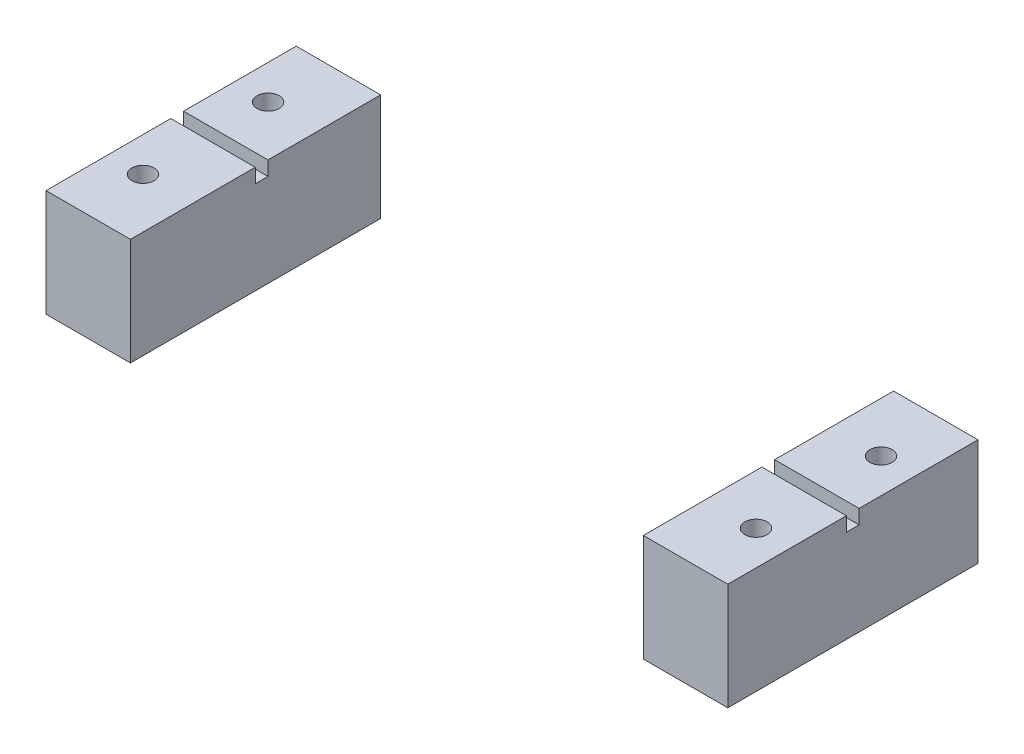
ISO-10303-21;
HEADER;
FILE_DESCRIPTION(('STEP AP214'),'2;1');
FILE_NAME('part.step','',(''),(''),'','','');
FILE_SCHEMA(('AUTOMOTIVE_DESIGN { 1 0 10303 214 1 1 1 1 }'));
ENDSEC;
DATA;
#1=APPLICATION_CONTEXT('core data for automotive mechanical design processes');
#2=APPLICATION_PROTOCOL_DEFINITION('international standard','automotive_design',2000,#1);
#3=PRODUCT_CONTEXT('',#1,'mechanical');
#4=PRODUCT('Part','Part','',(#3));
#5=PRODUCT_RELATED_PRODUCT_CATEGORY('part','',(#4));
#6=PRODUCT_DEFINITION_FORMATION('','',#4);
#7=PRODUCT_DEFINITION_CONTEXT('part definition',#1,'design');
#8=PRODUCT_DEFINITION('design','',#6,#7);
#9=PRODUCT_DEFINITION_SHAPE('','',#8);
#10=(LENGTH_UNIT() NAMED_UNIT(*) SI_UNIT(.MILLI.,.METRE.));
#11=(NAMED_UNIT(*) PLANE_ANGLE_UNIT() SI_UNIT($,.RADIAN.));
#12=(NAMED_UNIT(*) SI_UNIT($,.STERADIAN.) SOLID_ANGLE_UNIT());
#13=UNCERTAINTY_MEASURE_WITH_UNIT(LENGTH_MEASURE(1.E-05),#10,'distance_accuracy_value','');
#14=(GEOMETRIC_REPRESENTATION_CONTEXT(3) GLOBAL_UNCERTAINTY_ASSIGNED_CONTEXT((#13)) GLOBAL_UNIT_ASSIGNED_CONTEXT((#10,
#11,#12)) REPRESENTATION_CONTEXT('',''));
#15=CARTESIAN_POINT('',(0.,0.,0.));
#16=DIRECTION('',(0.,0.,1.));
#17=DIRECTION('',(1.,0.,0.));
#18=AXIS2_PLACEMENT_3D('',#15,#16,#17);
#19=CARTESIAN_POINT('',(0.,8.5598,0.));
#20=DIRECTION('',(0.,1.,0.));
#21=DIRECTION('',(0.,0.,-1.));
#22=AXIS2_PLACEMENT_3D('',#19,#20,#21);
#23=PLANE('',#22);
#24=DIRECTION('',(-1.,0.,0.));
#25=VECTOR('',#24,1.);
#26=CARTESIAN_POINT('',(54.5,8.5598,10.5214854290003));
#27=LINE('',#26,#25);
#28=CARTESIAN_POINT('',(54.5,8.5598,10.5214854290003));
#29=VERTEX_POINT('',#28);
#30=CARTESIAN_POINT('',(47.75,8.5598,10.5214854290003));
#31=VERTEX_POINT('',#30);
#32=EDGE_CURVE('E141',#29,#31,#27,.T.);
#33=ORIENTED_EDGE('',*,*,#32,.T.);
#34=DIRECTION('',(0.,0.,1.));
#35=VECTOR('',#34,1.);
#36=CARTESIAN_POINT('',(47.75,8.5598,0.));
#37=LINE('',#36,#35);
#38=CARTESIAN_POINT('',(47.75,8.5598,20.));
#39=VERTEX_POINT('',#38);
#40=EDGE_CURVE('E161',#31,#39,#37,.T.);
#41=ORIENTED_EDGE('',*,*,#40,.T.);
#42=DIRECTION('',(1.,0.,0.));
#43=VECTOR('',#42,1.);
#44=CARTESIAN_POINT('',(0.,8.5598,20.));
#45=LINE('',#44,#43);
#46=CARTESIAN_POINT('',(54.5,8.5598,20.));
#47=VERTEX_POINT('',#46);
#48=EDGE_CURVE('E157',#39,#47,#45,.T.);
#49=ORIENTED_EDGE('',*,*,#48,.T.);
#50=DIRECTION('',(0.,0.,1.));
#51=VECTOR('',#50,1.);
#52=CARTESIAN_POINT('',(54.5,8.5598,0.));
#53=LINE('',#52,#51);
#54=EDGE_CURVE('E167',#29,#47,#53,.T.);
#55=ORIENTED_EDGE('',*,*,#54,.F.);
#56=EDGE_LOOP('',(#33,#41,#49,#55));
#57=FACE_BOUND('',#56,.T.);
#58=CARTESIAN_POINT('',(51.75,8.5598,15.));
#59=DIRECTION('',(0.,-1.,0.));
#60=DIRECTION('',(0.,0.,-1.));
#61=AXIS2_PLACEMENT_3D('',#58,#59,#60);
#62=CIRCLE('',#61,0.889000000000003);
#63=CARTESIAN_POINT('',(51.75,8.5598,14.111));
#64=VERTEX_POINT('',#63);
#65=EDGE_CURVE('E154',#64,#64,#62,.T.);
#66=ORIENTED_EDGE('',*,*,#65,.T.);
#67=EDGE_LOOP('',(#66));
#68=FACE_BOUND('',#67,.T.);
#69=ADVANCED_FACE('F49',(#57,#68),#23,.T.);
#70=CARTESIAN_POINT('',(0.,8.5598,20.));
#71=DIRECTION('',(0.,0.,1.));
#72=DIRECTION('',(-1.,0.,0.));
#73=AXIS2_PLACEMENT_3D('',#70,#71,#72);
#74=PLANE('',#73);
#75=DIRECTION('',(1.,0.,0.));
#76=VECTOR('',#75,1.);
#77=CARTESIAN_POINT('',(0.,0.,20.));
#78=LINE('',#77,#76);
#79=CARTESIAN_POINT('',(47.75,0.,20.));
#80=VERTEX_POINT('',#79);
#81=CARTESIAN_POINT('',(54.5,0.,20.));
#82=VERTEX_POINT('',#81);
#83=EDGE_CURVE('E176',#80,#82,#78,.T.);
#84=ORIENTED_EDGE('',*,*,#83,.T.);
#85=DIRECTION('',(0.,-1.,0.));
#86=VECTOR('',#85,1.);
#87=CARTESIAN_POINT('',(54.5,8.5598,20.));
#88=LINE('',#87,#86);
#89=EDGE_CURVE('E73',#47,#82,#88,.T.);
#90=ORIENTED_EDGE('',*,*,#89,.F.);
#91=ORIENTED_EDGE('',*,*,#48,.F.);
#92=DIRECTION('',(0.,-1.,0.));
#93=VECTOR('',#92,1.);
#94=CARTESIAN_POINT('',(47.75,8.5598,20.));
#95=LINE('',#94,#93);
#96=EDGE_CURVE('E12',#39,#80,#95,.T.);
#97=ORIENTED_EDGE('',*,*,#96,.T.);
#98=EDGE_LOOP('',(#84,#90,#91,#97));
#99=FACE_BOUND('',#98,.T.);
#100=ADVANCED_FACE('F196',(#99),#74,.T.);
#101=CARTESIAN_POINT('',(47.75,8.5598,0.));
#102=DIRECTION('',(-1.,0.,0.));
#103=DIRECTION('',(0.,0.,-1.));
#104=AXIS2_PLACEMENT_3D('',#101,#102,#103);
#105=PLANE('',#104);
#106=DIRECTION('',(0.,1.,0.));
#107=VECTOR('',#106,1.);
#108=CARTESIAN_POINT('',(47.75,7.4168,10.5214854290003));
#109=LINE('',#108,#107);
#110=CARTESIAN_POINT('',(47.75,7.4168,10.5214854290003));
#111=VERTEX_POINT('',#110);
#112=EDGE_CURVE('E140',#111,#31,#109,.T.);
#113=ORIENTED_EDGE('',*,*,#112,.F.);
#114=DIRECTION('',(0.,0.,-1.));
#115=VECTOR('',#114,1.);
#116=CARTESIAN_POINT('',(47.75,7.4168,10.5214854290003));
#117=LINE('',#116,#115);
#118=CARTESIAN_POINT('',(47.75,7.4168,9.50548542900026));
#119=VERTEX_POINT('',#118);
#120=EDGE_CURVE('E126',#111,#119,#117,.T.);
#121=ORIENTED_EDGE('',*,*,#120,.T.);
#122=DIRECTION('',(0.,1.,0.));
#123=VECTOR('',#122,1.);
#124=CARTESIAN_POINT('',(47.75,7.4168,9.50548542900026));
#125=LINE('',#124,#123);
#126=CARTESIAN_POINT('',(47.75,8.5598,9.50548542900026));
#127=VERTEX_POINT('',#126);
#128=EDGE_CURVE('E133',#119,#127,#125,.T.);
#129=ORIENTED_EDGE('',*,*,#128,.T.);
#130=CARTESIAN_POINT('',(47.75,8.5598,0.));
#131=VERTEX_POINT('',#130);
#132=EDGE_CURVE('E162',#131,#127,#37,.T.);
#133=ORIENTED_EDGE('',*,*,#132,.F.);
#134=DIRECTION('',(0.,-1.,0.));
#135=VECTOR('',#134,1.);
#136=CARTESIAN_POINT('',(47.75,8.5598,0.));
#137=LINE('',#136,#135);
#138=CARTESIAN_POINT('',(47.75,0.,0.));
#139=VERTEX_POINT('',#138);
#140=EDGE_CURVE('E57',#131,#139,#137,.T.);
#141=ORIENTED_EDGE('',*,*,#140,.T.);
#142=DIRECTION('',(0.,0.,1.));
#143=VECTOR('',#142,1.);
#144=CARTESIAN_POINT('',(47.75,0.,0.));
#145=LINE('',#144,#143);
#146=EDGE_CURVE('E178',#139,#80,#145,.T.);
#147=ORIENTED_EDGE('',*,*,#146,.T.);
#148=ORIENTED_EDGE('',*,*,#96,.F.);
#149=ORIENTED_EDGE('',*,*,#40,.F.);
#150=EDGE_LOOP('',(#113,#121,#129,#133,#141,#147,#148,#149));
#151=FACE_BOUND('',#150,.T.);
#152=ADVANCED_FACE('F139',(#151),#105,.T.);
#153=CARTESIAN_POINT('',(0.,8.5598,0.));
#154=DIRECTION('',(0.,0.,1.));
#155=DIRECTION('',(-1.,0.,0.));
#156=AXIS2_PLACEMENT_3D('',#153,#154,#155);
#157=PLANE('',#156);
#158=DIRECTION('',(1.,0.,0.));
#159=VECTOR('',#158,1.);
#160=CARTESIAN_POINT('',(0.,0.,0.));
#161=LINE('',#160,#159);
#162=CARTESIAN_POINT('',(54.5,0.,0.));
#163=VERTEX_POINT('',#162);
#164=EDGE_CURVE('E180',#139,#163,#161,.T.);
#165=ORIENTED_EDGE('',*,*,#164,.F.);
#166=ORIENTED_EDGE('',*,*,#140,.F.);
#167=DIRECTION('',(1.,0.,0.));
#168=VECTOR('',#167,1.);
#169=CARTESIAN_POINT('',(0.,8.5598,0.));
#170=LINE('',#169,#168);
#171=CARTESIAN_POINT('',(54.5,8.5598,0.));
#172=VERTEX_POINT('',#171);
#173=EDGE_CURVE('E164',#131,#172,#170,.T.);
#174=ORIENTED_EDGE('',*,*,#173,.T.);
#175=DIRECTION('',(0.,-1.,0.));
#176=VECTOR('',#175,1.);
#177=CARTESIAN_POINT('',(54.5,8.5598,0.));
#178=LINE('',#177,#176);
#179=EDGE_CURVE('E186',#172,#163,#178,.T.);
#180=ORIENTED_EDGE('',*,*,#179,.T.);
#181=EDGE_LOOP('',(#165,#166,#174,#180));
#182=FACE_BOUND('',#181,.T.);
#183=ADVANCED_FACE('F192',(#182),#157,.F.);
#184=CARTESIAN_POINT('',(54.5,8.5598,0.));
#185=DIRECTION('',(-1.,0.,0.));
#186=DIRECTION('',(0.,0.,-1.));
#187=AXIS2_PLACEMENT_3D('',#184,#185,#186);
#188=PLANE('',#187);
#189=ORIENTED_EDGE('',*,*,#54,.T.);
#190=ORIENTED_EDGE('',*,*,#89,.T.);
#191=DIRECTION('',(0.,0.,1.));
#192=VECTOR('',#191,1.);
#193=CARTESIAN_POINT('',(54.5,0.,0.));
#194=LINE('',#193,#192);
#195=EDGE_CURVE('E95',#163,#82,#194,.T.);
#196=ORIENTED_EDGE('',*,*,#195,.F.);
#197=ORIENTED_EDGE('',*,*,#179,.F.);
#198=CARTESIAN_POINT('',(54.5,8.5598,9.50548542900026));
#199=VERTEX_POINT('',#198);
#200=EDGE_CURVE('E168',#172,#199,#53,.T.);
#201=ORIENTED_EDGE('',*,*,#200,.T.);
#202=DIRECTION('',(0.,1.,0.));
#203=VECTOR('',#202,1.);
#204=CARTESIAN_POINT('',(54.5,7.4168,9.50548542900026));
#205=LINE('',#204,#203);
#206=CARTESIAN_POINT('',(54.5,7.4168,9.50548542900026));
#207=VERTEX_POINT('',#206);
#208=EDGE_CURVE('E136',#207,#199,#205,.T.);
#209=ORIENTED_EDGE('',*,*,#208,.F.);
#210=DIRECTION('',(0.,0.,1.));
#211=VECTOR('',#210,1.);
#212=CARTESIAN_POINT('',(54.5,7.4168,10.5214854290003));
#213=LINE('',#212,#211);
#214=CARTESIAN_POINT('',(54.5,7.4168,10.5214854290003));
#215=VERTEX_POINT('',#214);
#216=EDGE_CURVE('E129',#207,#215,#213,.T.);
#217=ORIENTED_EDGE('',*,*,#216,.T.);
#218=DIRECTION('',(0.,1.,0.));
#219=VECTOR('',#218,1.);
#220=CARTESIAN_POINT('',(54.5,7.4168,10.5214854290003));
#221=LINE('',#220,#219);
#222=EDGE_CURVE('E151',#215,#29,#221,.T.);
#223=ORIENTED_EDGE('',*,*,#222,.T.);
#224=EDGE_LOOP('',(#189,#190,#196,#197,#201,#209,#217,#223));
#225=FACE_BOUND('',#224,.T.);
#226=ADVANCED_FACE('F206',(#225),#188,.F.);
#227=CARTESIAN_POINT('',(51.75,8.5598,15.));
#228=DIRECTION('',(0.,-1.,0.));
#229=DIRECTION('',(0.,0.,1.));
#230=AXIS2_PLACEMENT_3D('',#227,#228,#229);
#231=CYLINDRICAL_SURFACE('',#230,0.889000000000003);
#232=ORIENTED_EDGE('',*,*,#65,.F.);
#233=EDGE_LOOP('',(#232));
#234=FACE_BOUND('',#233,.T.);
#235=CARTESIAN_POINT('',(51.75,0.,15.));
#236=DIRECTION('',(0.,-1.,0.));
#237=DIRECTION('',(0.,0.,-1.));
#238=AXIS2_PLACEMENT_3D('',#235,#236,#237);
#239=CIRCLE('',#238,0.889000000000003);
#240=CARTESIAN_POINT('',(51.75,0.,14.111));
#241=VERTEX_POINT('',#240);
#242=EDGE_CURVE('E150',#241,#241,#239,.T.);
#243=ORIENTED_EDGE('',*,*,#242,.T.);
#244=EDGE_LOOP('',(#243));
#245=FACE_BOUND('',#244,.T.);
#246=ADVANCED_FACE('F51',(#234,#245),#231,.F.);
#247=CARTESIAN_POINT('',(51.7500000000001,8.5598,5.00000000000001));
#248=DIRECTION('',(0.,-1.,0.));
#249=DIRECTION('',(0.,0.,1.));
#250=AXIS2_PLACEMENT_3D('',#247,#248,#249);
#251=CYLINDRICAL_SURFACE('',#250,0.889000000000003);
#252=CARTESIAN_POINT('',(51.7500000000001,8.5598,5.00000000000001));
#253=DIRECTION('',(0.,-1.,0.));
#254=DIRECTION('',(0.,0.,-1.));
#255=AXIS2_PLACEMENT_3D('',#252,#253,#254);
#256=CIRCLE('',#255,0.889000000000003);
#257=CARTESIAN_POINT('',(51.7500000000001,8.5598,4.11100000000001));
#258=VERTEX_POINT('',#257);
#259=EDGE_CURVE('E171',#258,#258,#256,.T.);
#260=ORIENTED_EDGE('',*,*,#259,.F.);
#261=EDGE_LOOP('',(#260));
#262=FACE_BOUND('',#261,.T.);
#263=CARTESIAN_POINT('',(51.7500000000001,0.,5.00000000000001));
#264=DIRECTION('',(0.,-1.,0.));
#265=DIRECTION('',(0.,0.,-1.));
#266=AXIS2_PLACEMENT_3D('',#263,#264,#265);
#267=CIRCLE('',#266,0.889000000000003);
#268=CARTESIAN_POINT('',(51.7500000000001,0.,4.11100000000001));
#269=VERTEX_POINT('',#268);
#270=EDGE_CURVE('E158',#269,#269,#267,.T.);
#271=ORIENTED_EDGE('',*,*,#270,.T.);
#272=EDGE_LOOP('',(#271));
#273=FACE_BOUND('',#272,.T.);
#274=ADVANCED_FACE('F211',(#262,#273),#251,.F.);
#275=DIRECTION('',(1.,0.,0.));
#276=VECTOR('',#275,1.);
#277=CARTESIAN_POINT('',(54.5,8.5598,9.50548542900026));
#278=LINE('',#277,#276);
#279=EDGE_CURVE('E64',#127,#199,#278,.T.);
#280=ORIENTED_EDGE('',*,*,#279,.T.);
#281=ORIENTED_EDGE('',*,*,#200,.F.);
#282=ORIENTED_EDGE('',*,*,#173,.F.);
#283=ORIENTED_EDGE('',*,*,#132,.T.);
#284=EDGE_LOOP('',(#280,#281,#282,#283));
#285=FACE_BOUND('',#284,.T.);
#286=ORIENTED_EDGE('',*,*,#259,.T.);
#287=EDGE_LOOP('',(#286));
#288=FACE_BOUND('',#287,.T.);
#289=ADVANCED_FACE('F208',(#285,#288),#23,.T.);
#290=CARTESIAN_POINT('',(0.,0.,0.));
#291=DIRECTION('',(0.,1.,0.));
#292=DIRECTION('',(0.,0.,-1.));
#293=AXIS2_PLACEMENT_3D('',#290,#291,#292);
#294=PLANE('',#293);
#295=ORIENTED_EDGE('',*,*,#242,.F.);
#296=EDGE_LOOP('',(#295));
#297=FACE_BOUND('',#296,.T.);
#298=ORIENTED_EDGE('',*,*,#83,.F.);
#299=ORIENTED_EDGE('',*,*,#146,.F.);
#300=ORIENTED_EDGE('',*,*,#164,.T.);
#301=ORIENTED_EDGE('',*,*,#195,.T.);
#302=EDGE_LOOP('',(#298,#299,#300,#301));
#303=FACE_BOUND('',#302,.T.);
#304=ORIENTED_EDGE('',*,*,#270,.F.);
#305=EDGE_LOOP('',(#304));
#306=FACE_BOUND('',#305,.T.);
#307=ADVANCED_FACE('F194',(#297,#303,#306),#294,.F.);
#308=CARTESIAN_POINT('',(54.5,7.4168,10.5214854290003));
#309=DIRECTION('',(0.,0.,1.));
#310=DIRECTION('',(-1.,0.,0.));
#311=AXIS2_PLACEMENT_3D('',#308,#309,#310);
#312=PLANE('',#311);
#313=ORIENTED_EDGE('',*,*,#32,.F.);
#314=ORIENTED_EDGE('',*,*,#222,.F.);
#315=DIRECTION('',(-1.,0.,0.));
#316=VECTOR('',#315,1.);
#317=CARTESIAN_POINT('',(54.5,7.4168,10.5214854290003));
#318=LINE('',#317,#316);
#319=EDGE_CURVE('E137',#215,#111,#318,.T.);
#320=ORIENTED_EDGE('',*,*,#319,.T.);
#321=ORIENTED_EDGE('',*,*,#112,.T.);
#322=EDGE_LOOP('',(#313,#314,#320,#321));
#323=FACE_BOUND('',#322,.T.);
#324=ADVANCED_FACE('F204',(#323),#312,.F.);
#325=CARTESIAN_POINT('',(54.5,7.4168,9.50548542900026));
#326=DIRECTION('',(0.,0.,-1.));
#327=DIRECTION('',(1.,0.,0.));
#328=AXIS2_PLACEMENT_3D('',#325,#326,#327);
#329=PLANE('',#328);
#330=ORIENTED_EDGE('',*,*,#279,.F.);
#331=ORIENTED_EDGE('',*,*,#128,.F.);
#332=DIRECTION('',(1.,0.,0.));
#333=VECTOR('',#332,1.);
#334=CARTESIAN_POINT('',(54.5,7.4168,9.50548542900026));
#335=LINE('',#334,#333);
#336=EDGE_CURVE('E123',#119,#207,#335,.T.);
#337=ORIENTED_EDGE('',*,*,#336,.T.);
#338=ORIENTED_EDGE('',*,*,#208,.T.);
#339=EDGE_LOOP('',(#330,#331,#337,#338));
#340=FACE_BOUND('',#339,.T.);
#341=ADVANCED_FACE('F134',(#340),#329,.F.);
#342=CARTESIAN_POINT('',(0.,7.4168,0.));
#343=DIRECTION('',(0.,-1.,0.));
#344=DIRECTION('',(0.,0.,1.));
#345=AXIS2_PLACEMENT_3D('',#342,#343,#344);
#346=PLANE('',#345);
#347=ORIENTED_EDGE('',*,*,#120,.F.);
#348=ORIENTED_EDGE('',*,*,#319,.F.);
#349=ORIENTED_EDGE('',*,*,#216,.F.);
#350=ORIENTED_EDGE('',*,*,#336,.F.);
#351=EDGE_LOOP('',(#347,#348,#349,#350));
#352=FACE_BOUND('',#351,.T.);
#353=ADVANCED_FACE('F124',(#352),#346,.F.);
#354=CLOSED_SHELL('',(#69,#100,#152,#183,#226,#246,#274,#289,#307,#324,#341,#353));
#355=MANIFOLD_SOLID_BREP('B2',#354);
#356=CARTESIAN_POINT('',(0.,8.5598,0.));
#357=DIRECTION('',(0.,1.,0.));
#358=DIRECTION('',(0.,0.,-1.));
#359=AXIS2_PLACEMENT_3D('',#356,#357,#358);
#360=PLANE('',#359);
#361=DIRECTION('',(-1.,0.,0.));
#362=VECTOR('',#361,1.);
#363=CARTESIAN_POINT('',(6.75,8.5598,10.0214854290003));
#364=LINE('',#363,#362);
#365=CARTESIAN_POINT('',(6.75,8.5598,10.0214854290003));
#366=VERTEX_POINT('',#365);
#367=CARTESIAN_POINT('',(0.,8.5598,10.0214854290003));
#368=VERTEX_POINT('',#367);
#369=EDGE_CURVE('E417',#366,#368,#364,.T.);
#370=ORIENTED_EDGE('',*,*,#369,.T.);
#371=DIRECTION('',(0.,0.,1.));
#372=VECTOR('',#371,1.);
#373=CARTESIAN_POINT('',(0.,8.5598,0.));
#374=LINE('',#373,#372);
#375=CARTESIAN_POINT('',(0.,8.5598,20.));
#376=VERTEX_POINT('',#375);
#377=EDGE_CURVE('E444',#368,#376,#374,.T.);
#378=ORIENTED_EDGE('',*,*,#377,.T.);
#379=DIRECTION('',(1.,0.,0.));
#380=VECTOR('',#379,1.);
#381=CARTESIAN_POINT('',(0.,8.5598,20.));
#382=LINE('',#381,#380);
#383=CARTESIAN_POINT('',(6.75,8.5598,20.));
#384=VERTEX_POINT('',#383);
#385=EDGE_CURVE('E441',#376,#384,#382,.T.);
#386=ORIENTED_EDGE('',*,*,#385,.T.);
#387=DIRECTION('',(0.,0.,1.));
#388=VECTOR('',#387,1.);
#389=CARTESIAN_POINT('',(6.75,8.5598,0.));
#390=LINE('',#389,#388);
#391=EDGE_CURVE('E439',#366,#384,#390,.T.);
#392=ORIENTED_EDGE('',*,*,#391,.F.);
#393=EDGE_LOOP('',(#370,#378,#386,#392));
#394=FACE_BOUND('',#393,.T.);
#395=CARTESIAN_POINT('',(2.75000000000001,8.5598,15.));
#396=DIRECTION('',(0.,-1.,0.));
#397=DIRECTION('',(0.,0.,-1.));
#398=AXIS2_PLACEMENT_3D('',#395,#396,#397);
#399=CIRCLE('',#398,0.889);
#400=CARTESIAN_POINT('',(2.75000000000001,8.5598,14.111));
#401=VERTEX_POINT('',#400);
#402=EDGE_CURVE('E433',#401,#401,#399,.T.);
#403=ORIENTED_EDGE('',*,*,#402,.T.);
#404=EDGE_LOOP('',(#403));
#405=FACE_BOUND('',#404,.T.);
#406=ADVANCED_FACE('F325',(#394,#405),#360,.T.);
#407=CARTESIAN_POINT('',(0.,8.5598,0.));
#408=DIRECTION('',(0.,0.,1.));
#409=DIRECTION('',(-1.,0.,0.));
#410=AXIS2_PLACEMENT_3D('',#407,#408,#409);
#411=PLANE('',#410);
#412=DIRECTION('',(1.,0.,0.));
#413=VECTOR('',#412,1.);
#414=CARTESIAN_POINT('',(0.,0.,0.));
#415=LINE('',#414,#413);
#416=CARTESIAN_POINT('',(0.,0.,0.));
#417=VERTEX_POINT('',#416);
#418=CARTESIAN_POINT('',(6.75,0.,0.));
#419=VERTEX_POINT('',#418);
#420=EDGE_CURVE('E452',#417,#419,#415,.T.);
#421=ORIENTED_EDGE('',*,*,#420,.F.);
#422=DIRECTION('',(0.,-1.,0.));
#423=VECTOR('',#422,1.);
#424=CARTESIAN_POINT('',(0.,8.5598,0.));
#425=LINE('',#424,#423);
#426=CARTESIAN_POINT('',(0.,8.5598,0.));
#427=VERTEX_POINT('',#426);
#428=EDGE_CURVE('E446',#427,#417,#425,.T.);
#429=ORIENTED_EDGE('',*,*,#428,.F.);
#430=DIRECTION('',(1.,0.,0.));
#431=VECTOR('',#430,1.);
#432=CARTESIAN_POINT('',(0.,8.5598,0.));
#433=LINE('',#432,#431);
#434=CARTESIAN_POINT('',(6.75,8.5598,0.));
#435=VERTEX_POINT('',#434);
#436=EDGE_CURVE('E436',#427,#435,#433,.T.);
#437=ORIENTED_EDGE('',*,*,#436,.T.);
#438=DIRECTION('',(0.,-1.,0.));
#439=VECTOR('',#438,1.);
#440=CARTESIAN_POINT('',(6.75,8.5598,0.));
#441=LINE('',#440,#439);
#442=EDGE_CURVE('E47',#435,#419,#441,.T.);
#443=ORIENTED_EDGE('',*,*,#442,.T.);
#444=EDGE_LOOP('',(#421,#429,#437,#443));
#445=FACE_BOUND('',#444,.T.);
#446=ADVANCED_FACE('F476',(#445),#411,.F.);
#447=CARTESIAN_POINT('',(6.75,8.5598,0.));
#448=DIRECTION('',(-1.,0.,0.));
#449=DIRECTION('',(0.,0.,-1.));
#450=AXIS2_PLACEMENT_3D('',#447,#448,#449);
#451=PLANE('',#450);
#452=ORIENTED_EDGE('',*,*,#391,.T.);
#453=DIRECTION('',(0.,-1.,0.));
#454=VECTOR('',#453,1.);
#455=CARTESIAN_POINT('',(6.75,8.5598,20.));
#456=LINE('',#455,#454);
#457=CARTESIAN_POINT('',(6.75,0.,20.));
#458=VERTEX_POINT('',#457);
#459=EDGE_CURVE('E333',#384,#458,#456,.T.);
#460=ORIENTED_EDGE('',*,*,#459,.T.);
#461=DIRECTION('',(0.,0.,1.));
#462=VECTOR('',#461,1.);
#463=CARTESIAN_POINT('',(6.75,0.,0.));
#464=LINE('',#463,#462);
#465=EDGE_CURVE('E454',#419,#458,#464,.T.);
#466=ORIENTED_EDGE('',*,*,#465,.F.);
#467=ORIENTED_EDGE('',*,*,#442,.F.);
#468=CARTESIAN_POINT('',(6.75,8.5598,9.00548542900026));
#469=VERTEX_POINT('',#468);
#470=EDGE_CURVE('E375',#435,#469,#390,.T.);
#471=ORIENTED_EDGE('',*,*,#470,.T.);
#472=DIRECTION('',(0.,1.,0.));
#473=VECTOR('',#472,1.);
#474=CARTESIAN_POINT('',(6.75,7.4168,9.00548542900026));
#475=LINE('',#474,#473);
#476=CARTESIAN_POINT('',(6.75,7.4168,9.00548542900026));
#477=VERTEX_POINT('',#476);
#478=EDGE_CURVE('E411',#477,#469,#475,.T.);
#479=ORIENTED_EDGE('',*,*,#478,.F.);
#480=DIRECTION('',(0.,0.,1.));
#481=VECTOR('',#480,1.);
#482=CARTESIAN_POINT('',(6.75,7.4168,10.0214854290003));
#483=LINE('',#482,#481);
#484=CARTESIAN_POINT('',(6.75,7.4168,10.0214854290003));
#485=VERTEX_POINT('',#484);
#486=EDGE_CURVE('E406',#477,#485,#483,.T.);
#487=ORIENTED_EDGE('',*,*,#486,.T.);
#488=DIRECTION('',(0.,1.,0.));
#489=VECTOR('',#488,1.);
#490=CARTESIAN_POINT('',(6.75,7.4168,10.0214854290003));
#491=LINE('',#490,#489);
#492=EDGE_CURVE('E427',#485,#366,#491,.T.);
#493=ORIENTED_EDGE('',*,*,#492,.T.);
#494=EDGE_LOOP('',(#452,#460,#466,#467,#471,#479,#487,#493));
#495=FACE_BOUND('',#494,.T.);
#496=ADVANCED_FACE('F466',(#495),#451,.F.);
#497=CARTESIAN_POINT('',(0.,8.5598,20.));
#498=DIRECTION('',(0.,0.,1.));
#499=DIRECTION('',(-1.,0.,0.));
#500=AXIS2_PLACEMENT_3D('',#497,#498,#499);
#501=PLANE('',#500);
#502=DIRECTION('',(1.,0.,0.));
#503=VECTOR('',#502,1.);
#504=CARTESIAN_POINT('',(0.,0.,20.));
#505=LINE('',#504,#503);
#506=CARTESIAN_POINT('',(0.,0.,20.));
#507=VERTEX_POINT('',#506);
#508=EDGE_CURVE('E457',#507,#458,#505,.T.);
#509=ORIENTED_EDGE('',*,*,#508,.T.);
#510=ORIENTED_EDGE('',*,*,#459,.F.);
#511=ORIENTED_EDGE('',*,*,#385,.F.);
#512=DIRECTION('',(0.,-1.,0.));
#513=VECTOR('',#512,1.);
#514=CARTESIAN_POINT('',(0.,8.5598,20.));
#515=LINE('',#514,#513);
#516=EDGE_CURVE('E461',#376,#507,#515,.T.);
#517=ORIENTED_EDGE('',*,*,#516,.T.);
#518=EDGE_LOOP('',(#509,#510,#511,#517));
#519=FACE_BOUND('',#518,.T.);
#520=ADVANCED_FACE('F470',(#519),#501,.T.);
#521=CARTESIAN_POINT('',(2.75000000000001,8.5598,15.));
#522=DIRECTION('',(0.,-1.,0.));
#523=DIRECTION('',(0.,0.,1.));
#524=AXIS2_PLACEMENT_3D('',#521,#522,#523);
#525=CYLINDRICAL_SURFACE('',#524,0.889);
#526=ORIENTED_EDGE('',*,*,#402,.F.);
#527=EDGE_LOOP('',(#526));
#528=FACE_BOUND('',#527,.T.);
#529=CARTESIAN_POINT('',(2.75000000000001,0.,15.));
#530=DIRECTION('',(0.,-1.,0.));
#531=DIRECTION('',(0.,0.,-1.));
#532=AXIS2_PLACEMENT_3D('',#529,#530,#531);
#533=CIRCLE('',#532,0.889);
#534=CARTESIAN_POINT('',(2.75000000000001,0.,14.111));
#535=VERTEX_POINT('',#534);
#536=EDGE_CURVE('E449',#535,#535,#533,.T.);
#537=ORIENTED_EDGE('',*,*,#536,.T.);
#538=EDGE_LOOP('',(#537));
#539=FACE_BOUND('',#538,.T.);
#540=ADVANCED_FACE('F510',(#528,#539),#525,.F.);
#541=CARTESIAN_POINT('',(2.75000000000015,8.5598,5.));
#542=DIRECTION('',(0.,-1.,0.));
#543=DIRECTION('',(0.,0.,1.));
#544=AXIS2_PLACEMENT_3D('',#541,#542,#543);
#545=CYLINDRICAL_SURFACE('',#544,0.889);
#546=CARTESIAN_POINT('',(2.75000000000015,8.5598,5.));
#547=DIRECTION('',(0.,-1.,0.));
#548=DIRECTION('',(0.,0.,-1.));
#549=AXIS2_PLACEMENT_3D('',#546,#547,#548);
#550=CIRCLE('',#549,0.889);
#551=CARTESIAN_POINT('',(2.75000000000015,8.5598,4.111));
#552=VERTEX_POINT('',#551);
#553=EDGE_CURVE('E430',#552,#552,#550,.T.);
#554=ORIENTED_EDGE('',*,*,#553,.F.);
#555=EDGE_LOOP('',(#554));
#556=FACE_BOUND('',#555,.T.);
#557=CARTESIAN_POINT('',(2.75000000000015,0.,5.));
#558=DIRECTION('',(0.,-1.,0.));
#559=DIRECTION('',(0.,0.,-1.));
#560=AXIS2_PLACEMENT_3D('',#557,#558,#559);
#561=CIRCLE('',#560,0.889);
#562=CARTESIAN_POINT('',(2.75000000000015,0.,4.111));
#563=VERTEX_POINT('',#562);
#564=EDGE_CURVE('E426',#563,#563,#561,.T.);
#565=ORIENTED_EDGE('',*,*,#564,.T.);
#566=EDGE_LOOP('',(#565));
#567=FACE_BOUND('',#566,.T.);
#568=ADVANCED_FACE('F327',(#556,#567),#545,.F.);
#569=CARTESIAN_POINT('',(0.,8.5598,0.));
#570=DIRECTION('',(-1.,0.,0.));
#571=DIRECTION('',(0.,0.,-1.));
#572=AXIS2_PLACEMENT_3D('',#569,#570,#571);
#573=PLANE('',#572);
#574=DIRECTION('',(0.,1.,0.));
#575=VECTOR('',#574,1.);
#576=CARTESIAN_POINT('',(0.,7.4168,10.0214854290003));
#577=LINE('',#576,#575);
#578=CARTESIAN_POINT('',(0.,7.4168,10.0214854290003));
#579=VERTEX_POINT('',#578);
#580=EDGE_CURVE('E416',#579,#368,#577,.T.);
#581=ORIENTED_EDGE('',*,*,#580,.F.);
#582=DIRECTION('',(0.,0.,-1.));
#583=VECTOR('',#582,1.);
#584=CARTESIAN_POINT('',(0.,7.4168,10.0214854290003));
#585=LINE('',#584,#583);
#586=CARTESIAN_POINT('',(0.,7.4168,9.00548542900026));
#587=VERTEX_POINT('',#586);
#588=EDGE_CURVE('E403',#579,#587,#585,.T.);
#589=ORIENTED_EDGE('',*,*,#588,.T.);
#590=DIRECTION('',(0.,1.,0.));
#591=VECTOR('',#590,1.);
#592=CARTESIAN_POINT('',(0.,7.4168,9.00548542900026));
#593=LINE('',#592,#591);
#594=CARTESIAN_POINT('',(0.,8.5598,9.00548542900026));
#595=VERTEX_POINT('',#594);
#596=EDGE_CURVE('E409',#587,#595,#593,.T.);
#597=ORIENTED_EDGE('',*,*,#596,.T.);
#598=EDGE_CURVE('E348',#427,#595,#374,.T.);
#599=ORIENTED_EDGE('',*,*,#598,.F.);
#600=ORIENTED_EDGE('',*,*,#428,.T.);
#601=DIRECTION('',(0.,0.,1.));
#602=VECTOR('',#601,1.);
#603=CARTESIAN_POINT('',(0.,0.,0.));
#604=LINE('',#603,#602);
#605=EDGE_CURVE('E370',#417,#507,#604,.T.);
#606=ORIENTED_EDGE('',*,*,#605,.T.);
#607=ORIENTED_EDGE('',*,*,#516,.F.);
#608=ORIENTED_EDGE('',*,*,#377,.F.);
#609=EDGE_LOOP('',(#581,#589,#597,#599,#600,#606,#607,#608));
#610=FACE_BOUND('',#609,.T.);
#611=ADVANCED_FACE('F414',(#610),#573,.T.);
#612=DIRECTION('',(1.,0.,0.));
#613=VECTOR('',#612,1.);
#614=CARTESIAN_POINT('',(6.75,8.5598,9.00548542900026));
#615=LINE('',#614,#613);
#616=EDGE_CURVE('E340',#595,#469,#615,.T.);
#617=ORIENTED_EDGE('',*,*,#616,.T.);
#618=ORIENTED_EDGE('',*,*,#470,.F.);
#619=ORIENTED_EDGE('',*,*,#436,.F.);
#620=ORIENTED_EDGE('',*,*,#598,.T.);
#621=EDGE_LOOP('',(#617,#618,#619,#620));
#622=FACE_BOUND('',#621,.T.);
#623=ORIENTED_EDGE('',*,*,#553,.T.);
#624=EDGE_LOOP('',(#623));
#625=FACE_BOUND('',#624,.T.);
#626=ADVANCED_FACE('F490',(#622,#625),#360,.T.);
#627=CARTESIAN_POINT('',(0.,0.,0.));
#628=DIRECTION('',(0.,1.,0.));
#629=DIRECTION('',(0.,0.,-1.));
#630=AXIS2_PLACEMENT_3D('',#627,#628,#629);
#631=PLANE('',#630);
#632=ORIENTED_EDGE('',*,*,#564,.F.);
#633=EDGE_LOOP('',(#632));
#634=FACE_BOUND('',#633,.T.);
#635=ORIENTED_EDGE('',*,*,#536,.F.);
#636=EDGE_LOOP('',(#635));
#637=FACE_BOUND('',#636,.T.);
#638=ORIENTED_EDGE('',*,*,#420,.T.);
#639=ORIENTED_EDGE('',*,*,#465,.T.);
#640=ORIENTED_EDGE('',*,*,#508,.F.);
#641=ORIENTED_EDGE('',*,*,#605,.F.);
#642=EDGE_LOOP('',(#638,#639,#640,#641));
#643=FACE_BOUND('',#642,.T.);
#644=ADVANCED_FACE('F472',(#634,#637,#643),#631,.F.);
#645=CARTESIAN_POINT('',(6.75,7.4168,10.0214854290003));
#646=DIRECTION('',(0.,0.,1.));
#647=DIRECTION('',(-1.,0.,0.));
#648=AXIS2_PLACEMENT_3D('',#645,#646,#647);
#649=PLANE('',#648);
#650=ORIENTED_EDGE('',*,*,#369,.F.);
#651=ORIENTED_EDGE('',*,*,#492,.F.);
#652=DIRECTION('',(-1.,0.,0.));
#653=VECTOR('',#652,1.);
#654=CARTESIAN_POINT('',(6.75,7.4168,10.0214854290003));
#655=LINE('',#654,#653);
#656=EDGE_CURVE('E412',#485,#579,#655,.T.);
#657=ORIENTED_EDGE('',*,*,#656,.T.);
#658=ORIENTED_EDGE('',*,*,#580,.T.);
#659=EDGE_LOOP('',(#650,#651,#657,#658));
#660=FACE_BOUND('',#659,.T.);
#661=ADVANCED_FACE('F482',(#660),#649,.F.);
#662=CARTESIAN_POINT('',(6.75,7.4168,9.00548542900026));
#663=DIRECTION('',(0.,0.,-1.));
#664=DIRECTION('',(1.,0.,0.));
#665=AXIS2_PLACEMENT_3D('',#662,#663,#664);
#666=PLANE('',#665);
#667=ORIENTED_EDGE('',*,*,#616,.F.);
#668=ORIENTED_EDGE('',*,*,#596,.F.);
#669=DIRECTION('',(1.,0.,0.));
#670=VECTOR('',#669,1.);
#671=CARTESIAN_POINT('',(6.75,7.4168,9.00548542900026));
#672=LINE('',#671,#670);
#673=EDGE_CURVE('E400',#587,#477,#672,.T.);
#674=ORIENTED_EDGE('',*,*,#673,.T.);
#675=ORIENTED_EDGE('',*,*,#478,.T.);
#676=EDGE_LOOP('',(#667,#668,#674,#675));
#677=FACE_BOUND('',#676,.T.);
#678=ADVANCED_FACE('F410',(#677),#666,.F.);
#679=CARTESIAN_POINT('',(0.,7.4168,0.));
#680=DIRECTION('',(0.,-1.,0.));
#681=DIRECTION('',(0.,0.,1.));
#682=AXIS2_PLACEMENT_3D('',#679,#680,#681);
#683=PLANE('',#682);
#684=ORIENTED_EDGE('',*,*,#588,.F.);
#685=ORIENTED_EDGE('',*,*,#656,.F.);
#686=ORIENTED_EDGE('',*,*,#486,.F.);
#687=ORIENTED_EDGE('',*,*,#673,.F.);
#688=EDGE_LOOP('',(#684,#685,#686,#687));
#689=FACE_BOUND('',#688,.T.);
#690=ADVANCED_FACE('F401',(#689),#683,.F.);
#691=CLOSED_SHELL('',(#406,#446,#496,#520,#540,#568,#611,#626,#644,#661,#678,#690));
#692=MANIFOLD_SOLID_BREP('B6',#691);
#693=ADVANCED_BREP_SHAPE_REPRESENTATION('',(#18,#355,#692),#14);
#694=SHAPE_DEFINITION_REPRESENTATION(#9,#693);
ENDSEC;
END-ISO-10303-21;
